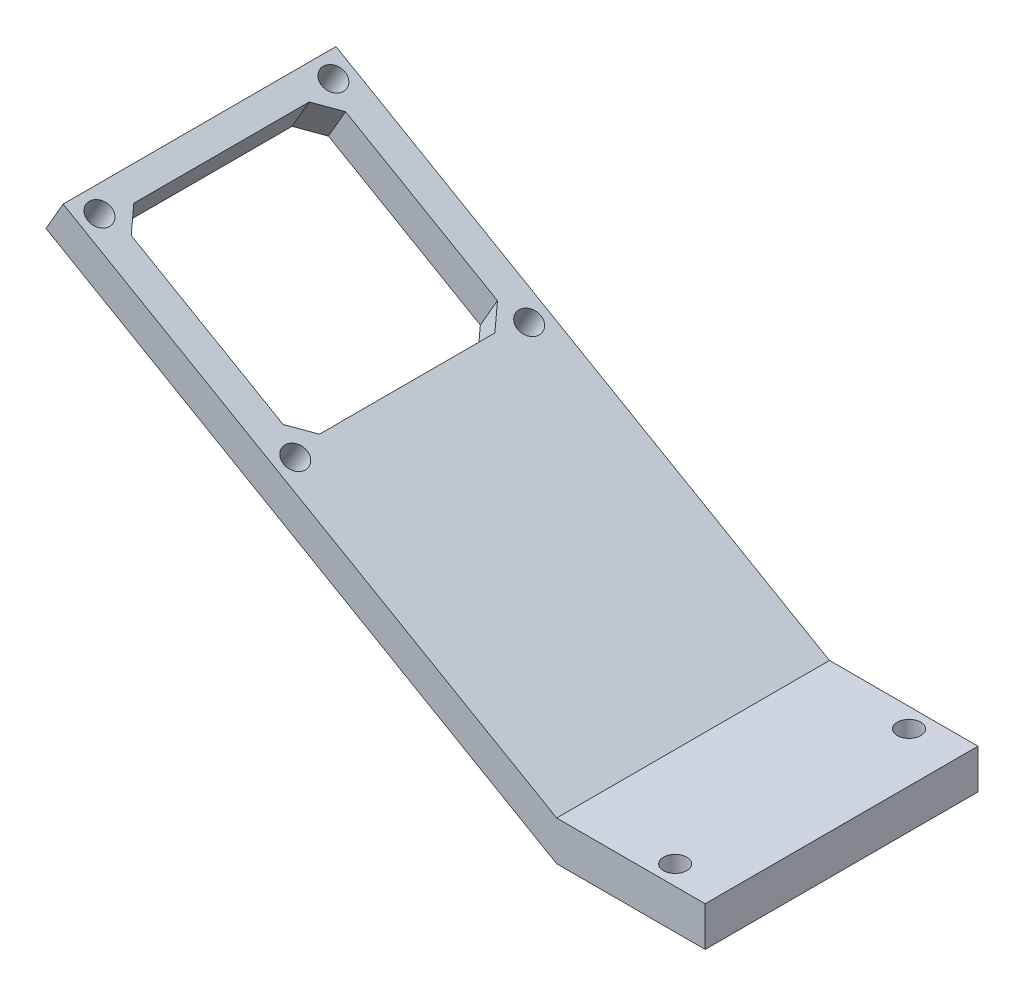
ISO-10303-21;
HEADER;
FILE_DESCRIPTION(('STEP AP214'),'2;1');
FILE_NAME('part.step','',(''),(''),'','','');
FILE_SCHEMA(('AUTOMOTIVE_DESIGN { 1 0 10303 214 1 1 1 1 }'));
ENDSEC;
DATA;
#1=APPLICATION_CONTEXT('core data for automotive mechanical design processes');
#2=APPLICATION_PROTOCOL_DEFINITION('international standard','automotive_design',2000,#1);
#3=PRODUCT_CONTEXT('',#1,'mechanical');
#4=PRODUCT('Part','Part','',(#3));
#5=PRODUCT_RELATED_PRODUCT_CATEGORY('part','',(#4));
#6=PRODUCT_DEFINITION_FORMATION('','',#4);
#7=PRODUCT_DEFINITION_CONTEXT('part definition',#1,'design');
#8=PRODUCT_DEFINITION('design','',#6,#7);
#9=PRODUCT_DEFINITION_SHAPE('','',#8);
#10=(LENGTH_UNIT() NAMED_UNIT(*) SI_UNIT(.MILLI.,.METRE.));
#11=(NAMED_UNIT(*) PLANE_ANGLE_UNIT() SI_UNIT($,.RADIAN.));
#12=(NAMED_UNIT(*) SI_UNIT($,.STERADIAN.) SOLID_ANGLE_UNIT());
#13=UNCERTAINTY_MEASURE_WITH_UNIT(LENGTH_MEASURE(1.E-05),#10,'distance_accuracy_value','');
#14=(GEOMETRIC_REPRESENTATION_CONTEXT(3) GLOBAL_UNCERTAINTY_ASSIGNED_CONTEXT((#13)) GLOBAL_UNIT_ASSIGNED_CONTEXT((#10,
#11,#12)) REPRESENTATION_CONTEXT('',''));
#15=CARTESIAN_POINT('',(0.,0.,0.));
#16=DIRECTION('',(0.,0.,1.));
#17=DIRECTION('',(1.,0.,0.));
#18=AXIS2_PLACEMENT_3D('',#15,#16,#17);
#19=CARTESIAN_POINT('',(0.,0.,35.));
#20=DIRECTION('',(-0.499999999999994,-0.866025403784442,0.));
#21=DIRECTION('',(0.866025403784442,-0.499999999999994,0.));
#22=AXIS2_PLACEMENT_3D('',#19,#20,#21);
#23=PLANE('',#22);
#24=CARTESIAN_POINT('',(-36.0266567974328,20.7999999999998,2.5));
#25=DIRECTION('',(0.499999999999994,0.866025403784442,0.));
#26=DIRECTION('',(-0.866025403784442,0.499999999999995,0.));
#27=AXIS2_PLACEMENT_3D('',#24,#25,#26);
#28=CIRCLE('',#27,1.49999999999999);
#29=CARTESIAN_POINT('',(-37.3256949031095,21.5499999999998,2.5));
#30=VERTEX_POINT('',#29);
#31=EDGE_CURVE('E340',#30,#30,#28,.T.);
#32=ORIENTED_EDGE('',*,*,#31,.F.);
#33=EDGE_LOOP('',(#32));
#34=FACE_BOUND('',#33,.T.);
#35=CARTESIAN_POINT('',(-61.1413935071816,35.2999999999996,32.5));
#36=DIRECTION('',(0.499999999999994,0.866025403784442,0.));
#37=DIRECTION('',(-0.866025403784442,0.499999999999995,0.));
#38=AXIS2_PLACEMENT_3D('',#35,#36,#37);
#39=CIRCLE('',#38,1.49999999999999);
#40=CARTESIAN_POINT('',(-62.4404316128583,36.0499999999996,32.5));
#41=VERTEX_POINT('',#40);
#42=EDGE_CURVE('E356',#41,#41,#39,.T.);
#43=ORIENTED_EDGE('',*,*,#42,.F.);
#44=EDGE_LOOP('',(#43));
#45=FACE_BOUND('',#44,.T.);
#46=DIRECTION('',(0.,0.,1.));
#47=VECTOR('',#46,1.);
#48=CARTESIAN_POINT('',(-36.6761758502711,21.1749999999998,0.));
#49=LINE('',#48,#47);
#50=CARTESIAN_POINT('',(-36.6761758502711,21.1749999999998,6.25000000000001));
#51=VERTEX_POINT('',#50);
#52=CARTESIAN_POINT('',(-36.6761758502711,21.1749999999998,28.75));
#53=VERTEX_POINT('',#52);
#54=EDGE_CURVE('E160',#51,#53,#49,.T.);
#55=ORIENTED_EDGE('',*,*,#54,.T.);
#56=DIRECTION('',(0.612372435695796,-0.353553390593269,-0.707106781186548));
#57=VECTOR('',#56,1.);
#58=CARTESIAN_POINT('',(-5.88897274573427,3.39999999999999,-6.80000000000005));
#59=LINE('',#58,#57);
#60=CARTESIAN_POINT('',(-38.8412393597322,22.4249999999998,31.25));
#61=VERTEX_POINT('',#60);
#62=EDGE_CURVE('E70',#61,#53,#59,.T.);
#63=ORIENTED_EDGE('',*,*,#62,.F.);
#64=DIRECTION('',(0.866025403784442,-0.499999999999994,0.));
#65=VECTOR('',#64,1.);
#66=CARTESIAN_POINT('',(0.,0.,31.25));
#67=LINE('',#66,#65);
#68=CARTESIAN_POINT('',(-58.3268109448822,33.6749999999996,31.25));
#69=VERTEX_POINT('',#68);
#70=EDGE_CURVE('E187',#69,#61,#67,.T.);
#71=ORIENTED_EDGE('',*,*,#70,.F.);
#72=DIRECTION('',(-0.612372435695796,0.353553390593269,-0.707106781186548));
#73=VECTOR('',#72,1.);
#74=CARTESIAN_POINT('',(-42.6950524065731,24.6499999999998,49.3));
#75=LINE('',#74,#73);
#76=CARTESIAN_POINT('',(-60.4918744543433,34.9249999999996,28.75));
#77=VERTEX_POINT('',#76);
#78=EDGE_CURVE('E183',#69,#77,#75,.T.);
#79=ORIENTED_EDGE('',*,*,#78,.T.);
#80=DIRECTION('',(0.,0.,1.));
#81=VECTOR('',#80,1.);
#82=CARTESIAN_POINT('',(-60.4918744543433,34.9249999999996,0.));
#83=LINE('',#82,#81);
#84=CARTESIAN_POINT('',(-60.4918744543433,34.9249999999996,6.25000000000003));
#85=VERTEX_POINT('',#84);
#86=EDGE_CURVE('E179',#85,#77,#83,.T.);
#87=ORIENTED_EDGE('',*,*,#86,.F.);
#88=DIRECTION('',(-0.612372435695796,0.353553390593269,0.707106781186548));
#89=VECTOR('',#88,1.);
#90=CARTESIAN_POINT('',(-27.5396078403453,15.8999999999999,-31.8));
#91=LINE('',#90,#89);
#92=CARTESIAN_POINT('',(-58.3268109448822,33.6749999999996,3.75));
#93=VERTEX_POINT('',#92);
#94=EDGE_CURVE('E172',#93,#85,#91,.T.);
#95=ORIENTED_EDGE('',*,*,#94,.F.);
#96=DIRECTION('',(0.866025403784442,-0.499999999999994,0.));
#97=VECTOR('',#96,1.);
#98=CARTESIAN_POINT('',(0.,0.,3.74999999999999));
#99=LINE('',#98,#97);
#100=CARTESIAN_POINT('',(-38.8412393597322,22.4249999999998,3.75));
#101=VERTEX_POINT('',#100);
#102=EDGE_CURVE('E168',#93,#101,#99,.T.);
#103=ORIENTED_EDGE('',*,*,#102,.T.);
#104=DIRECTION('',(0.612372435695797,-0.35355339059327,0.707106781186548));
#105=VECTOR('',#104,1.);
#106=CARTESIAN_POINT('',(-21.044417311962,12.1499999999999,24.3));
#107=LINE('',#106,#105);
#108=EDGE_CURVE('E150',#101,#51,#107,.T.);
#109=ORIENTED_EDGE('',*,*,#108,.T.);
#110=EDGE_LOOP('',(#55,#63,#71,#79,#87,#95,#103,#109));
#111=FACE_BOUND('',#110,.T.);
#112=DIRECTION('',(-0.866025403784442,0.499999999999994,0.));
#113=VECTOR('',#112,1.);
#114=CARTESIAN_POINT('',(0.,0.,0.));
#115=LINE('',#114,#113);
#116=CARTESIAN_POINT('',(0.,0.,0.));
#117=VERTEX_POINT('',#116);
#118=CARTESIAN_POINT('',(-63.3064570166427,36.5499999999996,0.));
#119=VERTEX_POINT('',#118);
#120=EDGE_CURVE('E241',#117,#119,#115,.T.);
#121=ORIENTED_EDGE('',*,*,#120,.T.);
#122=DIRECTION('',(0.,0.,-1.));
#123=VECTOR('',#122,1.);
#124=CARTESIAN_POINT('',(-63.3064570166427,36.5499999999996,35.));
#125=LINE('',#124,#123);
#126=CARTESIAN_POINT('',(-63.3064570166427,36.5499999999996,35.));
#127=VERTEX_POINT('',#126);
#128=EDGE_CURVE('E258',#127,#119,#125,.T.);
#129=ORIENTED_EDGE('',*,*,#128,.F.);
#130=DIRECTION('',(-0.866025403784442,0.499999999999994,0.));
#131=VECTOR('',#130,1.);
#132=CARTESIAN_POINT('',(0.,0.,35.));
#133=LINE('',#132,#131);
#134=CARTESIAN_POINT('',(0.,0.,35.));
#135=VERTEX_POINT('',#134);
#136=EDGE_CURVE('E255',#135,#127,#133,.T.);
#137=ORIENTED_EDGE('',*,*,#136,.F.);
#138=DIRECTION('',(0.,0.,-1.));
#139=VECTOR('',#138,1.);
#140=CARTESIAN_POINT('',(0.,0.,35.));
#141=LINE('',#140,#139);
#142=EDGE_CURVE('E281',#135,#117,#141,.T.);
#143=ORIENTED_EDGE('',*,*,#142,.T.);
#144=EDGE_LOOP('',(#121,#129,#137,#143));
#145=FACE_BOUND('',#144,.T.);
#146=CARTESIAN_POINT('',(-36.0266567974328,20.7999999999998,32.5));
#147=DIRECTION('',(0.499999999999994,0.866025403784442,0.));
#148=DIRECTION('',(-0.866025403784442,0.499999999999995,0.));
#149=AXIS2_PLACEMENT_3D('',#146,#147,#148);
#150=CIRCLE('',#149,1.49999999999999);
#151=CARTESIAN_POINT('',(-37.3256949031095,21.5499999999998,32.5));
#152=VERTEX_POINT('',#151);
#153=EDGE_CURVE('E328',#152,#152,#150,.T.);
#154=ORIENTED_EDGE('',*,*,#153,.F.);
#155=EDGE_LOOP('',(#154));
#156=FACE_BOUND('',#155,.T.);
#157=CARTESIAN_POINT('',(-61.1413935071816,35.2999999999996,2.5));
#158=DIRECTION('',(0.499999999999994,0.866025403784442,0.));
#159=DIRECTION('',(-0.866025403784442,0.499999999999995,0.));
#160=AXIS2_PLACEMENT_3D('',#157,#158,#159);
#161=CIRCLE('',#160,1.49999999999999);
#162=CARTESIAN_POINT('',(-62.4404316128583,36.0499999999996,2.5));
#163=VERTEX_POINT('',#162);
#164=EDGE_CURVE('E331',#163,#163,#161,.T.);
#165=ORIENTED_EDGE('',*,*,#164,.F.);
#166=EDGE_LOOP('',(#165));
#167=FACE_BOUND('',#166,.T.);
#168=ADVANCED_FACE('F45',(#34,#45,#111,#145,#156,#167),#23,.F.);
#169=CARTESIAN_POINT('',(-63.3064570166428,36.5499999999995,35.));
#170=DIRECTION('',(-0.866025403784443,0.499999999999993,0.));
#171=DIRECTION('',(-0.499999999999993,-0.866025403784443,0.));
#172=AXIS2_PLACEMENT_3D('',#169,#170,#171);
#173=PLANE('',#172);
#174=DIRECTION('',(0.499999999999993,0.866025403784443,0.));
#175=VECTOR('',#174,1.);
#176=CARTESIAN_POINT('',(-63.3064570166428,36.5499999999995,0.));
#177=LINE('',#176,#175);
#178=CARTESIAN_POINT('',(-65.5061615422552,32.7399999999996,0.));
#179=VERTEX_POINT('',#178);
#180=EDGE_CURVE('E235',#179,#119,#177,.T.);
#181=ORIENTED_EDGE('',*,*,#180,.F.);
#182=DIRECTION('',(0.,0.,-1.));
#183=VECTOR('',#182,1.);
#184=CARTESIAN_POINT('',(-65.5061615422552,32.7399999999996,35.));
#185=LINE('',#184,#183);
#186=CARTESIAN_POINT('',(-65.5061615422552,32.7399999999996,35.));
#187=VERTEX_POINT('',#186);
#188=EDGE_CURVE('E11',#187,#179,#185,.T.);
#189=ORIENTED_EDGE('',*,*,#188,.F.);
#190=DIRECTION('',(0.499999999999993,0.866025403784443,0.));
#191=VECTOR('',#190,1.);
#192=CARTESIAN_POINT('',(-63.3064570166428,36.5499999999995,35.));
#193=LINE('',#192,#191);
#194=EDGE_CURVE('E236',#187,#127,#193,.T.);
#195=ORIENTED_EDGE('',*,*,#194,.T.);
#196=ORIENTED_EDGE('',*,*,#128,.T.);
#197=EDGE_LOOP('',(#181,#189,#195,#196));
#198=FACE_BOUND('',#197,.T.);
#199=ADVANCED_FACE('F47',(#198),#173,.T.);
#200=CARTESIAN_POINT('',(-2.19970452561246,-3.81000000000003,35.));
#201=DIRECTION('',(-0.499999999999995,-0.866025403784442,0.));
#202=DIRECTION('',(0.866025403784442,-0.499999999999995,0.));
#203=AXIS2_PLACEMENT_3D('',#200,#201,#202);
#204=PLANE('',#203);
#205=CARTESIAN_POINT('',(-63.3410980327941,31.4899999999996,2.5));
#206=DIRECTION('',(-0.499999999999995,-0.866025403784442,0.));
#207=DIRECTION('',(0.866025403784442,-0.499999999999995,0.));
#208=AXIS2_PLACEMENT_3D('',#205,#206,#207);
#209=CIRCLE('',#208,1.49999999999999);
#210=CARTESIAN_POINT('',(-62.0420599271174,30.7399999999996,2.5));
#211=VERTEX_POINT('',#210);
#212=EDGE_CURVE('E334',#211,#211,#209,.T.);
#213=ORIENTED_EDGE('',*,*,#212,.F.);
#214=EDGE_LOOP('',(#213));
#215=FACE_BOUND('',#214,.T.);
#216=CARTESIAN_POINT('',(-38.2263613230453,16.9899999999997,2.5));
#217=DIRECTION('',(-0.499999999999995,-0.866025403784442,0.));
#218=DIRECTION('',(0.866025403784442,-0.499999999999995,0.));
#219=AXIS2_PLACEMENT_3D('',#216,#217,#218);
#220=CIRCLE('',#219,1.49999999999999);
#221=CARTESIAN_POINT('',(-36.9273232173686,16.2399999999998,2.5));
#222=VERTEX_POINT('',#221);
#223=EDGE_CURVE('E49',#222,#222,#220,.T.);
#224=ORIENTED_EDGE('',*,*,#223,.F.);
#225=EDGE_LOOP('',(#224));
#226=FACE_BOUND('',#225,.T.);
#227=CARTESIAN_POINT('',(-38.2263613230453,16.9899999999997,32.5));
#228=DIRECTION('',(-0.499999999999995,-0.866025403784442,0.));
#229=DIRECTION('',(0.866025403784442,-0.499999999999995,0.));
#230=AXIS2_PLACEMENT_3D('',#227,#228,#229);
#231=CIRCLE('',#230,1.49999999999999);
#232=CARTESIAN_POINT('',(-36.9273232173686,16.2399999999998,32.5));
#233=VERTEX_POINT('',#232);
#234=EDGE_CURVE('E352',#233,#233,#231,.T.);
#235=ORIENTED_EDGE('',*,*,#234,.F.);
#236=EDGE_LOOP('',(#235));
#237=FACE_BOUND('',#236,.T.);
#238=CARTESIAN_POINT('',(-63.3410980327941,31.4899999999996,32.5));
#239=DIRECTION('',(-0.499999999999995,-0.866025403784442,0.));
#240=DIRECTION('',(0.866025403784442,-0.499999999999995,0.));
#241=AXIS2_PLACEMENT_3D('',#238,#239,#240);
#242=CIRCLE('',#241,1.49999999999999);
#243=CARTESIAN_POINT('',(-62.0420599271174,30.7399999999996,32.5));
#244=VERTEX_POINT('',#243);
#245=EDGE_CURVE('E360',#244,#244,#242,.T.);
#246=ORIENTED_EDGE('',*,*,#245,.F.);
#247=EDGE_LOOP('',(#246));
#248=FACE_BOUND('',#247,.T.);
#249=DIRECTION('',(-0.612372435695796,0.353553390593269,0.707106781186548));
#250=VECTOR('',#249,1.);
#251=CARTESIAN_POINT('',(-23.2441218375745,8.33999999999987,10.7));
#252=LINE('',#251,#250);
#253=CARTESIAN_POINT('',(-38.8758803758836,17.3649999999997,28.75));
#254=VERTEX_POINT('',#253);
#255=CARTESIAN_POINT('',(-41.0409438853447,18.6149999999997,31.25));
#256=VERTEX_POINT('',#255);
#257=EDGE_CURVE('E232',#254,#256,#252,.T.);
#258=ORIENTED_EDGE('',*,*,#257,.F.);
#259=DIRECTION('',(0.,0.,-1.));
#260=VECTOR('',#259,1.);
#261=CARTESIAN_POINT('',(-38.8758803758836,17.3649999999997,35.));
#262=LINE('',#261,#260);
#263=CARTESIAN_POINT('',(-38.8758803758836,17.3649999999997,6.25000000000001));
#264=VERTEX_POINT('',#263);
#265=EDGE_CURVE('E194',#254,#264,#262,.T.);
#266=ORIENTED_EDGE('',*,*,#265,.T.);
#267=DIRECTION('',(-0.612372435695797,0.35355339059327,-0.707106781186548));
#268=VECTOR('',#267,1.);
#269=CARTESIAN_POINT('',(-8.08867727134668,-0.410000000000056,41.8));
#270=LINE('',#269,#268);
#271=CARTESIAN_POINT('',(-41.0409438853447,18.6149999999997,3.75));
#272=VERTEX_POINT('',#271);
#273=EDGE_CURVE('E153',#264,#272,#270,.T.);
#274=ORIENTED_EDGE('',*,*,#273,.T.);
#275=DIRECTION('',(-0.866025403784442,0.499999999999995,0.));
#276=VECTOR('',#275,1.);
#277=CARTESIAN_POINT('',(-2.19970452561246,-3.81000000000003,3.74999999999999));
#278=LINE('',#277,#276);
#279=CARTESIAN_POINT('',(-60.5265154704946,29.8649999999996,3.75));
#280=VERTEX_POINT('',#279);
#281=EDGE_CURVE('E215',#272,#280,#278,.T.);
#282=ORIENTED_EDGE('',*,*,#281,.T.);
#283=DIRECTION('',(0.612372435695796,-0.353553390593269,-0.707106781186548));
#284=VECTOR('',#283,1.);
#285=CARTESIAN_POINT('',(-44.8947569321855,20.8399999999997,-14.3));
#286=LINE('',#285,#284);
#287=CARTESIAN_POINT('',(-62.6915789799558,31.1149999999996,6.25000000000004));
#288=VERTEX_POINT('',#287);
#289=EDGE_CURVE('E219',#288,#280,#286,.T.);
#290=ORIENTED_EDGE('',*,*,#289,.F.);
#291=DIRECTION('',(0.,0.,-1.));
#292=VECTOR('',#291,1.);
#293=CARTESIAN_POINT('',(-62.6915789799558,31.1149999999996,35.));
#294=LINE('',#293,#292);
#295=CARTESIAN_POINT('',(-62.6915789799557,31.1149999999996,28.75));
#296=VERTEX_POINT('',#295);
#297=EDGE_CURVE('E222',#296,#288,#294,.T.);
#298=ORIENTED_EDGE('',*,*,#297,.F.);
#299=DIRECTION('',(0.612372435695796,-0.353553390593269,0.707106781186548));
#300=VECTOR('',#299,1.);
#301=CARTESIAN_POINT('',(-29.7393123659578,12.0899999999998,66.8));
#302=LINE('',#301,#300);
#303=CARTESIAN_POINT('',(-60.5265154704946,29.8649999999996,31.25));
#304=VERTEX_POINT('',#303);
#305=EDGE_CURVE('E225',#296,#304,#302,.T.);
#306=ORIENTED_EDGE('',*,*,#305,.T.);
#307=DIRECTION('',(-0.866025403784442,0.499999999999995,0.));
#308=VECTOR('',#307,1.);
#309=CARTESIAN_POINT('',(-2.19970452561246,-3.81000000000003,31.25));
#310=LINE('',#309,#308);
#311=EDGE_CURVE('E229',#256,#304,#310,.T.);
#312=ORIENTED_EDGE('',*,*,#311,.F.);
#313=EDGE_LOOP('',(#258,#266,#274,#282,#290,#298,#306,#312));
#314=FACE_BOUND('',#313,.T.);
#315=DIRECTION('',(-0.866025403784442,0.499999999999995,0.));
#316=VECTOR('',#315,1.);
#317=CARTESIAN_POINT('',(-2.19970452561246,-3.81000000000003,0.));
#318=LINE('',#317,#316);
#319=CARTESIAN_POINT('',(0.,-5.08,0.));
#320=VERTEX_POINT('',#319);
#321=EDGE_CURVE('E262',#320,#179,#318,.T.);
#322=ORIENTED_EDGE('',*,*,#321,.F.);
#323=DIRECTION('',(0.,0.,-1.));
#324=VECTOR('',#323,1.);
#325=CARTESIAN_POINT('',(0.,-5.08,35.));
#326=LINE('',#325,#324);
#327=CARTESIAN_POINT('',(0.,-5.08,35.));
#328=VERTEX_POINT('',#327);
#329=EDGE_CURVE('E55',#328,#320,#326,.T.);
#330=ORIENTED_EDGE('',*,*,#329,.F.);
#331=DIRECTION('',(-0.866025403784442,0.499999999999995,0.));
#332=VECTOR('',#331,1.);
#333=CARTESIAN_POINT('',(-2.19970452561246,-3.81000000000003,35.));
#334=LINE('',#333,#332);
#335=EDGE_CURVE('E240',#328,#187,#334,.T.);
#336=ORIENTED_EDGE('',*,*,#335,.T.);
#337=ORIENTED_EDGE('',*,*,#188,.T.);
#338=EDGE_LOOP('',(#322,#330,#336,#337));
#339=FACE_BOUND('',#338,.T.);
#340=ADVANCED_FACE('F300',(#215,#226,#237,#248,#314,#339),#204,.T.);
#341=CARTESIAN_POINT('',(0.,-5.08,35.));
#342=DIRECTION('',(0.,-1.,0.));
#343=DIRECTION('',(1.,0.,0.));
#344=AXIS2_PLACEMENT_3D('',#341,#342,#343);
#345=PLANE('',#344);
#346=CARTESIAN_POINT('',(12.7,-5.08000000000001,2.5));
#347=DIRECTION('',(0.,1.,0.));
#348=DIRECTION('',(0.,0.,1.));
#349=AXIS2_PLACEMENT_3D('',#346,#347,#348);
#350=CIRCLE('',#349,1.5);
#351=CARTESIAN_POINT('',(12.7,-5.08000000000001,4.));
#352=VERTEX_POINT('',#351);
#353=EDGE_CURVE('E432',#352,#352,#350,.T.);
#354=ORIENTED_EDGE('',*,*,#353,.T.);
#355=EDGE_LOOP('',(#354));
#356=FACE_BOUND('',#355,.T.);
#357=CARTESIAN_POINT('',(12.7,-5.08000000000001,32.5));
#358=DIRECTION('',(0.,1.,0.));
#359=DIRECTION('',(0.,0.,1.));
#360=AXIS2_PLACEMENT_3D('',#357,#358,#359);
#361=CIRCLE('',#360,1.5);
#362=CARTESIAN_POINT('',(12.7,-5.08000000000001,34.));
#363=VERTEX_POINT('',#362);
#364=EDGE_CURVE('E335',#363,#363,#361,.T.);
#365=ORIENTED_EDGE('',*,*,#364,.T.);
#366=EDGE_LOOP('',(#365));
#367=FACE_BOUND('',#366,.T.);
#368=DIRECTION('',(-1.,0.,0.));
#369=VECTOR('',#368,1.);
#370=CARTESIAN_POINT('',(0.,-5.08,0.));
#371=LINE('',#370,#369);
#372=CARTESIAN_POINT('',(19.05,-5.08,0.));
#373=VERTEX_POINT('',#372);
#374=EDGE_CURVE('E266',#373,#320,#371,.T.);
#375=ORIENTED_EDGE('',*,*,#374,.F.);
#376=DIRECTION('',(0.,0.,-1.));
#377=VECTOR('',#376,1.);
#378=CARTESIAN_POINT('',(19.05,-5.08,35.));
#379=LINE('',#378,#377);
#380=CARTESIAN_POINT('',(19.05,-5.08,35.));
#381=VERTEX_POINT('',#380);
#382=EDGE_CURVE('E289',#381,#373,#379,.T.);
#383=ORIENTED_EDGE('',*,*,#382,.F.);
#384=DIRECTION('',(-1.,0.,0.));
#385=VECTOR('',#384,1.);
#386=CARTESIAN_POINT('',(0.,-5.08,35.));
#387=LINE('',#386,#385);
#388=EDGE_CURVE('E245',#381,#328,#387,.T.);
#389=ORIENTED_EDGE('',*,*,#388,.T.);
#390=ORIENTED_EDGE('',*,*,#329,.T.);
#391=EDGE_LOOP('',(#375,#383,#389,#390));
#392=FACE_BOUND('',#391,.T.);
#393=ADVANCED_FACE('F296',(#356,#367,#392),#345,.T.);
#394=CARTESIAN_POINT('',(19.05,0.,35.));
#395=DIRECTION('',(-1.,0.,0.));
#396=DIRECTION('',(0.,0.,1.));
#397=AXIS2_PLACEMENT_3D('',#394,#395,#396);
#398=PLANE('',#397);
#399=DIRECTION('',(0.,1.,0.));
#400=VECTOR('',#399,1.);
#401=CARTESIAN_POINT('',(19.05,0.,0.));
#402=LINE('',#401,#400);
#403=CARTESIAN_POINT('',(19.05,0.,0.));
#404=VERTEX_POINT('',#403);
#405=EDGE_CURVE('E270',#373,#404,#402,.T.);
#406=ORIENTED_EDGE('',*,*,#405,.T.);
#407=DIRECTION('',(0.,0.,-1.));
#408=VECTOR('',#407,1.);
#409=CARTESIAN_POINT('',(19.05,0.,35.));
#410=LINE('',#409,#408);
#411=CARTESIAN_POINT('',(19.05,0.,35.));
#412=VERTEX_POINT('',#411);
#413=EDGE_CURVE('E285',#412,#404,#410,.T.);
#414=ORIENTED_EDGE('',*,*,#413,.F.);
#415=DIRECTION('',(0.,1.,0.));
#416=VECTOR('',#415,1.);
#417=CARTESIAN_POINT('',(19.05,0.,35.));
#418=LINE('',#417,#416);
#419=EDGE_CURVE('E249',#381,#412,#418,.T.);
#420=ORIENTED_EDGE('',*,*,#419,.F.);
#421=ORIENTED_EDGE('',*,*,#382,.T.);
#422=EDGE_LOOP('',(#406,#414,#420,#421));
#423=FACE_BOUND('',#422,.T.);
#424=ADVANCED_FACE('F309',(#423),#398,.F.);
#425=CARTESIAN_POINT('',(0.,0.,35.));
#426=DIRECTION('',(0.,-1.,0.));
#427=DIRECTION('',(1.,0.,0.));
#428=AXIS2_PLACEMENT_3D('',#425,#426,#427);
#429=PLANE('',#428);
#430=CARTESIAN_POINT('',(12.7,0.,2.5));
#431=DIRECTION('',(0.,1.,0.));
#432=DIRECTION('',(0.,0.,1.));
#433=AXIS2_PLACEMENT_3D('',#430,#431,#432);
#434=CIRCLE('',#433,1.49999999999999);
#435=CARTESIAN_POINT('',(12.7,0.,3.99999999999999));
#436=VERTEX_POINT('',#435);
#437=EDGE_CURVE('E446',#436,#436,#434,.T.);
#438=ORIENTED_EDGE('',*,*,#437,.F.);
#439=EDGE_LOOP('',(#438));
#440=FACE_BOUND('',#439,.T.);
#441=CARTESIAN_POINT('',(12.7,0.,32.5));
#442=DIRECTION('',(0.,1.,0.));
#443=DIRECTION('',(0.,0.,1.));
#444=AXIS2_PLACEMENT_3D('',#441,#442,#443);
#445=CIRCLE('',#444,1.49999999999999);
#446=CARTESIAN_POINT('',(12.7,0.,34.));
#447=VERTEX_POINT('',#446);
#448=EDGE_CURVE('E343',#447,#447,#445,.T.);
#449=ORIENTED_EDGE('',*,*,#448,.F.);
#450=EDGE_LOOP('',(#449));
#451=FACE_BOUND('',#450,.T.);
#452=DIRECTION('',(-1.,0.,0.));
#453=VECTOR('',#452,1.);
#454=CARTESIAN_POINT('',(0.,0.,0.));
#455=LINE('',#454,#453);
#456=EDGE_CURVE('E273',#404,#117,#455,.T.);
#457=ORIENTED_EDGE('',*,*,#456,.T.);
#458=ORIENTED_EDGE('',*,*,#142,.F.);
#459=DIRECTION('',(-1.,0.,0.));
#460=VECTOR('',#459,1.);
#461=CARTESIAN_POINT('',(0.,0.,35.));
#462=LINE('',#461,#460);
#463=EDGE_CURVE('E252',#412,#135,#462,.T.);
#464=ORIENTED_EDGE('',*,*,#463,.F.);
#465=ORIENTED_EDGE('',*,*,#413,.T.);
#466=EDGE_LOOP('',(#457,#458,#464,#465));
#467=FACE_BOUND('',#466,.T.);
#468=ADVANCED_FACE('F313',(#440,#451,#467),#429,.F.);
#469=CARTESIAN_POINT('',(0.,0.,35.));
#470=DIRECTION('',(0.,0.,1.));
#471=DIRECTION('',(1.,0.,0.));
#472=AXIS2_PLACEMENT_3D('',#469,#470,#471);
#473=PLANE('',#472);
#474=ORIENTED_EDGE('',*,*,#194,.F.);
#475=ORIENTED_EDGE('',*,*,#335,.F.);
#476=ORIENTED_EDGE('',*,*,#388,.F.);
#477=ORIENTED_EDGE('',*,*,#419,.T.);
#478=ORIENTED_EDGE('',*,*,#463,.T.);
#479=ORIENTED_EDGE('',*,*,#136,.T.);
#480=EDGE_LOOP('',(#474,#475,#476,#477,#478,#479));
#481=FACE_BOUND('',#480,.T.);
#482=ADVANCED_FACE('F318',(#481),#473,.T.);
#483=CARTESIAN_POINT('',(0.,0.,0.));
#484=DIRECTION('',(0.,0.,1.));
#485=DIRECTION('',(1.,0.,0.));
#486=AXIS2_PLACEMENT_3D('',#483,#484,#485);
#487=PLANE('',#486);
#488=ORIENTED_EDGE('',*,*,#180,.T.);
#489=ORIENTED_EDGE('',*,*,#120,.F.);
#490=ORIENTED_EDGE('',*,*,#456,.F.);
#491=ORIENTED_EDGE('',*,*,#405,.F.);
#492=ORIENTED_EDGE('',*,*,#374,.T.);
#493=ORIENTED_EDGE('',*,*,#321,.T.);
#494=EDGE_LOOP('',(#488,#489,#490,#491,#492,#493));
#495=FACE_BOUND('',#494,.T.);
#496=ADVANCED_FACE('F304',(#495),#487,.F.);
#497=CARTESIAN_POINT('',(-24.4652176569101,-28.7749999999999,-6.80000000000005));
#498=DIRECTION('',(0.612372435695798,-0.35355339059327,0.707106781186547));
#499=DIRECTION('',(0.755928946018452,0.,-0.65465367070798));
#500=AXIS2_PLACEMENT_3D('',#497,#498,#499);
#501=PLANE('',#500);
#502=ORIENTED_EDGE('',*,*,#257,.T.);
#503=DIRECTION('',(0.499999999999994,0.866025403784442,0.));
#504=VECTOR('',#503,1.);
#505=CARTESIAN_POINT('',(-57.4174842709081,-9.75000000000015,31.25));
#506=LINE('',#505,#504);
#507=EDGE_CURVE('E191',#256,#61,#506,.T.);
#508=ORIENTED_EDGE('',*,*,#507,.T.);
#509=ORIENTED_EDGE('',*,*,#62,.T.);
#510=DIRECTION('',(0.499999999999994,0.866025403784442,0.));
#511=VECTOR('',#510,1.);
#512=CARTESIAN_POINT('',(-55.252420761447,-11.0000000000001,28.75));
#513=LINE('',#512,#511);
#514=EDGE_CURVE('E157',#254,#53,#513,.T.);
#515=ORIENTED_EDGE('',*,*,#514,.F.);
#516=EDGE_LOOP('',(#502,#508,#509,#515));
#517=FACE_BOUND('',#516,.T.);
#518=ADVANCED_FACE('F381',(#517),#501,.F.);
#519=CARTESIAN_POINT('',(-18.5762449111759,-32.1749999999999,31.25));
#520=DIRECTION('',(0.,0.,1.));
#521=DIRECTION('',(1.,0.,0.));
#522=AXIS2_PLACEMENT_3D('',#519,#520,#521);
#523=PLANE('',#522);
#524=ORIENTED_EDGE('',*,*,#311,.T.);
#525=DIRECTION('',(0.499999999999994,0.866025403784442,0.));
#526=VECTOR('',#525,1.);
#527=CARTESIAN_POINT('',(-76.9030558560581,1.49999999999972,31.25));
#528=LINE('',#527,#526);
#529=EDGE_CURVE('E195',#304,#69,#528,.T.);
#530=ORIENTED_EDGE('',*,*,#529,.T.);
#531=ORIENTED_EDGE('',*,*,#70,.T.);
#532=ORIENTED_EDGE('',*,*,#507,.F.);
#533=EDGE_LOOP('',(#524,#530,#531,#532));
#534=FACE_BOUND('',#533,.T.);
#535=ADVANCED_FACE('F383',(#534),#523,.F.);
#536=CARTESIAN_POINT('',(-61.2712973177489,-7.52500000000014,49.3));
#537=DIRECTION('',(0.612372435695798,-0.35355339059327,-0.707106781186547));
#538=DIRECTION('',(-0.755928946018452,0.,-0.65465367070798));
#539=AXIS2_PLACEMENT_3D('',#536,#537,#538);
#540=PLANE('',#539);
#541=DIRECTION('',(0.499999999999994,0.866025403784442,0.));
#542=VECTOR('',#541,1.);
#543=CARTESIAN_POINT('',(-79.0681193655192,2.74999999999971,28.75));
#544=LINE('',#543,#542);
#545=EDGE_CURVE('E198',#296,#77,#544,.T.);
#546=ORIENTED_EDGE('',*,*,#545,.T.);
#547=ORIENTED_EDGE('',*,*,#78,.F.);
#548=ORIENTED_EDGE('',*,*,#529,.F.);
#549=ORIENTED_EDGE('',*,*,#305,.F.);
#550=EDGE_LOOP('',(#546,#547,#548,#549));
#551=FACE_BOUND('',#550,.T.);
#552=ADVANCED_FACE('F389',(#551),#540,.T.);
#553=CARTESIAN_POINT('',(-79.0681193655192,2.74999999999971,0.));
#554=DIRECTION('',(-0.866025403784442,0.499999999999994,0.));
#555=DIRECTION('',(-0.499999999999994,-0.866025403784442,0.));
#556=AXIS2_PLACEMENT_3D('',#553,#554,#555);
#557=PLANE('',#556);
#558=ORIENTED_EDGE('',*,*,#297,.T.);
#559=DIRECTION('',(0.499999999999994,0.866025403784442,0.));
#560=VECTOR('',#559,1.);
#561=CARTESIAN_POINT('',(-79.0681193655192,2.74999999999972,6.25000000000003));
#562=LINE('',#561,#560);
#563=EDGE_CURVE('E201',#288,#85,#562,.T.);
#564=ORIENTED_EDGE('',*,*,#563,.T.);
#565=ORIENTED_EDGE('',*,*,#86,.T.);
#566=ORIENTED_EDGE('',*,*,#545,.F.);
#567=EDGE_LOOP('',(#558,#564,#565,#566));
#568=FACE_BOUND('',#567,.T.);
#569=ADVANCED_FACE('F393',(#568),#557,.F.);
#570=CARTESIAN_POINT('',(-46.1158527515212,-16.275,-31.8));
#571=DIRECTION('',(-0.612372435695798,0.35355339059327,-0.707106781186547));
#572=DIRECTION('',(-0.755928946018452,0.,0.65465367070798));
#573=AXIS2_PLACEMENT_3D('',#570,#571,#572);
#574=PLANE('',#573);
#575=ORIENTED_EDGE('',*,*,#289,.T.);
#576=DIRECTION('',(0.499999999999994,0.866025403784442,0.));
#577=VECTOR('',#576,1.);
#578=CARTESIAN_POINT('',(-76.9030558560581,1.49999999999972,3.75));
#579=LINE('',#578,#577);
#580=EDGE_CURVE('E204',#280,#93,#579,.T.);
#581=ORIENTED_EDGE('',*,*,#580,.T.);
#582=ORIENTED_EDGE('',*,*,#94,.T.);
#583=ORIENTED_EDGE('',*,*,#563,.F.);
#584=EDGE_LOOP('',(#575,#581,#582,#583));
#585=FACE_BOUND('',#584,.T.);
#586=ADVANCED_FACE('F397',(#585),#574,.F.);
#587=CARTESIAN_POINT('',(-18.5762449111759,-32.1749999999999,3.74999999999999));
#588=DIRECTION('',(0.,0.,1.));
#589=DIRECTION('',(1.,0.,0.));
#590=AXIS2_PLACEMENT_3D('',#587,#588,#589);
#591=PLANE('',#590);
#592=DIRECTION('',(0.499999999999994,0.866025403784442,0.));
#593=VECTOR('',#592,1.);
#594=CARTESIAN_POINT('',(-57.4174842709081,-9.75000000000015,3.75));
#595=LINE('',#594,#593);
#596=EDGE_CURVE('E156',#272,#101,#595,.T.);
#597=ORIENTED_EDGE('',*,*,#596,.T.);
#598=ORIENTED_EDGE('',*,*,#102,.F.);
#599=ORIENTED_EDGE('',*,*,#580,.F.);
#600=ORIENTED_EDGE('',*,*,#281,.F.);
#601=EDGE_LOOP('',(#597,#598,#599,#600));
#602=FACE_BOUND('',#601,.T.);
#603=ADVANCED_FACE('F400',(#602),#591,.T.);
#604=CARTESIAN_POINT('',(-39.6206622231378,-20.025,24.3));
#605=DIRECTION('',(-0.612372435695797,0.35355339059327,0.707106781186547));
#606=DIRECTION('',(0.755928946018453,0.,0.654653670707979));
#607=AXIS2_PLACEMENT_3D('',#604,#605,#606);
#608=PLANE('',#607);
#609=DIRECTION('',(0.499999999999994,0.866025403784442,0.));
#610=VECTOR('',#609,1.);
#611=CARTESIAN_POINT('',(-55.252420761447,-11.0000000000001,6.25000000000001));
#612=LINE('',#611,#610);
#613=EDGE_CURVE('E62',#264,#51,#612,.T.);
#614=ORIENTED_EDGE('',*,*,#613,.T.);
#615=ORIENTED_EDGE('',*,*,#108,.F.);
#616=ORIENTED_EDGE('',*,*,#596,.F.);
#617=ORIENTED_EDGE('',*,*,#273,.F.);
#618=EDGE_LOOP('',(#614,#615,#616,#617));
#619=FACE_BOUND('',#618,.T.);
#620=ADVANCED_FACE('F147',(#619),#608,.T.);
#621=CARTESIAN_POINT('',(-55.252420761447,-11.0000000000001,0.));
#622=DIRECTION('',(-0.866025403784442,0.499999999999994,0.));
#623=DIRECTION('',(-0.499999999999994,-0.866025403784442,0.));
#624=AXIS2_PLACEMENT_3D('',#621,#622,#623);
#625=PLANE('',#624);
#626=ORIENTED_EDGE('',*,*,#514,.T.);
#627=ORIENTED_EDGE('',*,*,#54,.F.);
#628=ORIENTED_EDGE('',*,*,#613,.F.);
#629=ORIENTED_EDGE('',*,*,#265,.F.);
#630=EDGE_LOOP('',(#626,#627,#628,#629));
#631=FACE_BOUND('',#630,.T.);
#632=ADVANCED_FACE('F161',(#631),#625,.T.);
#633=CARTESIAN_POINT('',(-61.1413935071816,35.2999999999996,32.5));
#634=DIRECTION('',(0.499999999999994,0.866025403784442,0.));
#635=DIRECTION('',(-0.866025403784442,0.499999999999995,0.));
#636=AXIS2_PLACEMENT_3D('',#633,#634,#635);
#637=CYLINDRICAL_SURFACE('',#636,1.49999999999999);
#638=ORIENTED_EDGE('',*,*,#245,.T.);
#639=EDGE_LOOP('',(#638));
#640=FACE_BOUND('',#639,.T.);
#641=ORIENTED_EDGE('',*,*,#42,.T.);
#642=EDGE_LOOP('',(#641));
#643=FACE_BOUND('',#642,.T.);
#644=ADVANCED_FACE('F413',(#640,#643),#637,.F.);
#645=CARTESIAN_POINT('',(-36.0266567974328,20.7999999999998,32.5));
#646=DIRECTION('',(0.499999999999994,0.866025403784442,0.));
#647=DIRECTION('',(-0.866025403784442,0.499999999999995,0.));
#648=AXIS2_PLACEMENT_3D('',#645,#646,#647);
#649=CYLINDRICAL_SURFACE('',#648,1.49999999999999);
#650=ORIENTED_EDGE('',*,*,#234,.T.);
#651=EDGE_LOOP('',(#650));
#652=FACE_BOUND('',#651,.T.);
#653=ORIENTED_EDGE('',*,*,#153,.T.);
#654=EDGE_LOOP('',(#653));
#655=FACE_BOUND('',#654,.T.);
#656=ADVANCED_FACE('F464',(#652,#655),#649,.F.);
#657=CARTESIAN_POINT('',(-36.0266567974328,20.7999999999998,2.5));
#658=DIRECTION('',(0.499999999999994,0.866025403784442,0.));
#659=DIRECTION('',(-0.866025403784442,0.499999999999995,0.));
#660=AXIS2_PLACEMENT_3D('',#657,#658,#659);
#661=CYLINDRICAL_SURFACE('',#660,1.49999999999999);
#662=ORIENTED_EDGE('',*,*,#223,.T.);
#663=EDGE_LOOP('',(#662));
#664=FACE_BOUND('',#663,.T.);
#665=ORIENTED_EDGE('',*,*,#31,.T.);
#666=EDGE_LOOP('',(#665));
#667=FACE_BOUND('',#666,.T.);
#668=ADVANCED_FACE('F368',(#664,#667),#661,.F.);
#669=CARTESIAN_POINT('',(-61.1413935071816,35.2999999999996,2.5));
#670=DIRECTION('',(0.499999999999994,0.866025403784442,0.));
#671=DIRECTION('',(-0.866025403784442,0.499999999999995,0.));
#672=AXIS2_PLACEMENT_3D('',#669,#670,#671);
#673=CYLINDRICAL_SURFACE('',#672,1.49999999999999);
#674=ORIENTED_EDGE('',*,*,#212,.T.);
#675=EDGE_LOOP('',(#674));
#676=FACE_BOUND('',#675,.T.);
#677=ORIENTED_EDGE('',*,*,#164,.T.);
#678=EDGE_LOOP('',(#677));
#679=FACE_BOUND('',#678,.T.);
#680=ADVANCED_FACE('F439',(#676,#679),#673,.F.);
#681=CARTESIAN_POINT('',(12.7,0.,32.5));
#682=DIRECTION('',(0.,1.,0.));
#683=DIRECTION('',(0.,0.,1.));
#684=AXIS2_PLACEMENT_3D('',#681,#682,#683);
#685=CYLINDRICAL_SURFACE('',#684,1.49999999999999);
#686=ORIENTED_EDGE('',*,*,#364,.F.);
#687=EDGE_LOOP('',(#686));
#688=FACE_BOUND('',#687,.T.);
#689=ORIENTED_EDGE('',*,*,#448,.T.);
#690=EDGE_LOOP('',(#689));
#691=FACE_BOUND('',#690,.T.);
#692=ADVANCED_FACE('F435',(#688,#691),#685,.F.);
#693=CARTESIAN_POINT('',(12.7,0.,2.5));
#694=DIRECTION('',(0.,1.,0.));
#695=DIRECTION('',(0.,0.,1.));
#696=AXIS2_PLACEMENT_3D('',#693,#694,#695);
#697=CYLINDRICAL_SURFACE('',#696,1.49999999999999);
#698=ORIENTED_EDGE('',*,*,#353,.F.);
#699=EDGE_LOOP('',(#698));
#700=FACE_BOUND('',#699,.T.);
#701=ORIENTED_EDGE('',*,*,#437,.T.);
#702=EDGE_LOOP('',(#701));
#703=FACE_BOUND('',#702,.T.);
#704=ADVANCED_FACE('F438',(#700,#703),#697,.F.);
#705=CLOSED_SHELL('',(#168,#199,#340,#393,#424,#468,#482,#496,#518,#535,#552,#569,#586,#603,
#620,#632,#644,#656,#668,#680,#692,#704));
#706=MANIFOLD_SOLID_BREP('B2',#705);
#707=ADVANCED_BREP_SHAPE_REPRESENTATION('',(#18,#706),#14);
#708=SHAPE_DEFINITION_REPRESENTATION(#9,#707);
ENDSEC;
END-ISO-10303-21;
